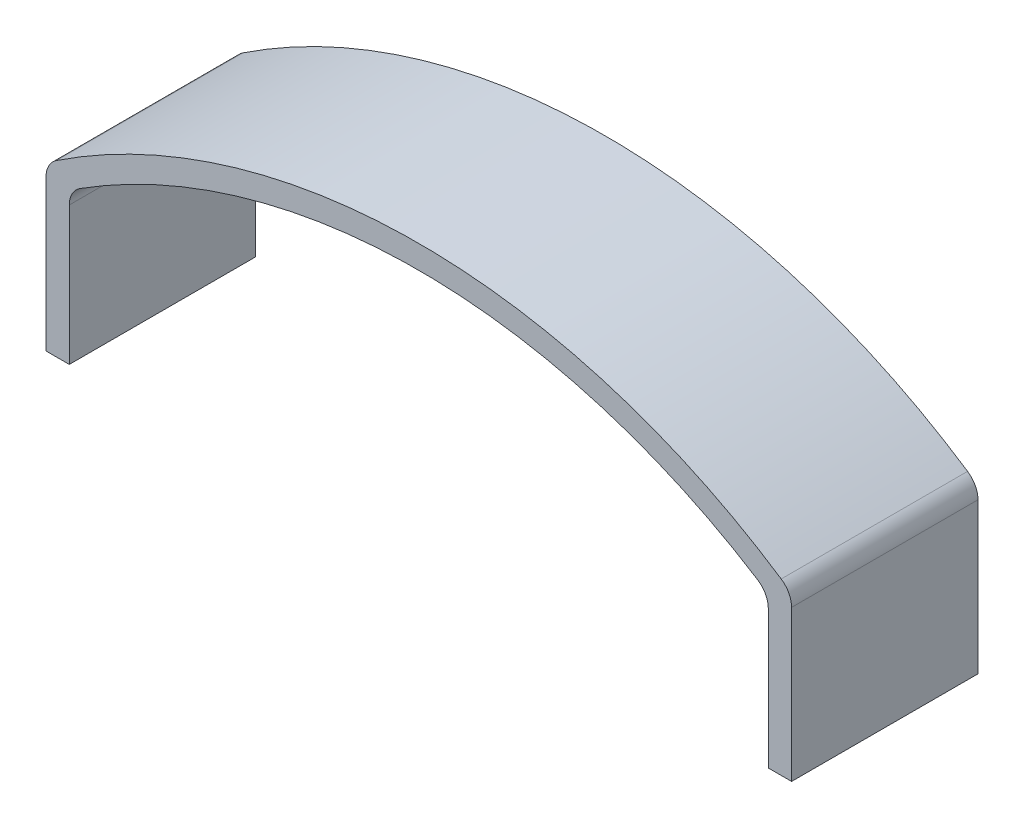
ISO-10303-21;
HEADER;
FILE_DESCRIPTION(('STEP AP214'),'2;1');
FILE_NAME('part.step','',(''),(''),'','','');
FILE_SCHEMA(('AUTOMOTIVE_DESIGN { 1 0 10303 214 1 1 1 1 }'));
ENDSEC;
DATA;
#1=APPLICATION_CONTEXT('core data for automotive mechanical design processes');
#2=APPLICATION_PROTOCOL_DEFINITION('international standard','automotive_design',2000,#1);
#3=PRODUCT_CONTEXT('',#1,'mechanical');
#4=PRODUCT('Part','Part','',(#3));
#5=PRODUCT_RELATED_PRODUCT_CATEGORY('part','',(#4));
#6=PRODUCT_DEFINITION_FORMATION('','',#4);
#7=PRODUCT_DEFINITION_CONTEXT('part definition',#1,'design');
#8=PRODUCT_DEFINITION('design','',#6,#7);
#9=PRODUCT_DEFINITION_SHAPE('','',#8);
#10=(LENGTH_UNIT() NAMED_UNIT(*) SI_UNIT(.MILLI.,.METRE.));
#11=(NAMED_UNIT(*) PLANE_ANGLE_UNIT() SI_UNIT($,.RADIAN.));
#12=(NAMED_UNIT(*) SI_UNIT($,.STERADIAN.) SOLID_ANGLE_UNIT());
#13=UNCERTAINTY_MEASURE_WITH_UNIT(LENGTH_MEASURE(1.E-05),#10,'distance_accuracy_value','');
#14=(GEOMETRIC_REPRESENTATION_CONTEXT(3) GLOBAL_UNCERTAINTY_ASSIGNED_CONTEXT((#13)) GLOBAL_UNIT_ASSIGNED_CONTEXT((#10,
#11,#12)) REPRESENTATION_CONTEXT('',''));
#15=CARTESIAN_POINT('',(0.,0.,0.));
#16=DIRECTION('',(0.,0.,1.));
#17=DIRECTION('',(1.,0.,0.));
#18=AXIS2_PLACEMENT_3D('',#15,#16,#17);
#19=CARTESIAN_POINT('',(-7.99559099778246,0.,2.));
#20=DIRECTION('',(0.,1.,0.));
#21=DIRECTION('',(0.,0.,1.));
#22=AXIS2_PLACEMENT_3D('',#19,#20,#21);
#23=PLANE('',#22);
#24=DIRECTION('',(1.,0.,0.));
#25=VECTOR('',#24,1.);
#26=CARTESIAN_POINT('',(-7.99559099778246,0.,-2.));
#27=LINE('',#26,#25);
#28=CARTESIAN_POINT('',(-7.99559099778246,0.,-2.));
#29=VERTEX_POINT('',#28);
#30=CARTESIAN_POINT('',(-7.49559099778246,0.,-2.));
#31=VERTEX_POINT('',#30);
#32=EDGE_CURVE('E128',#29,#31,#27,.T.);
#33=ORIENTED_EDGE('',*,*,#32,.T.);
#34=DIRECTION('',(0.,0.,-1.));
#35=VECTOR('',#34,1.);
#36=CARTESIAN_POINT('',(-7.49559099778246,0.,2.));
#37=LINE('',#36,#35);
#38=CARTESIAN_POINT('',(-7.49559099778246,0.,2.));
#39=VERTEX_POINT('',#38);
#40=EDGE_CURVE('E110',#39,#31,#37,.T.);
#41=ORIENTED_EDGE('',*,*,#40,.F.);
#42=DIRECTION('',(1.,0.,0.));
#43=VECTOR('',#42,1.);
#44=CARTESIAN_POINT('',(-7.99559099778246,0.,2.));
#45=LINE('',#44,#43);
#46=CARTESIAN_POINT('',(-7.99559099778246,0.,2.));
#47=VERTEX_POINT('',#46);
#48=EDGE_CURVE('E116',#47,#39,#45,.T.);
#49=ORIENTED_EDGE('',*,*,#48,.F.);
#50=DIRECTION('',(0.,0.,-1.));
#51=VECTOR('',#50,1.);
#52=CARTESIAN_POINT('',(-7.99559099778246,0.,2.));
#53=LINE('',#52,#51);
#54=EDGE_CURVE('E189',#47,#29,#53,.T.);
#55=ORIENTED_EDGE('',*,*,#54,.T.);
#56=EDGE_LOOP('',(#33,#41,#49,#55));
#57=FACE_BOUND('',#56,.T.);
#58=ADVANCED_FACE('F16',(#57),#23,.F.);
#59=CARTESIAN_POINT('',(-7.49559099778246,0.,2.));
#60=DIRECTION('',(-1.,0.,0.));
#61=DIRECTION('',(0.,0.,1.));
#62=AXIS2_PLACEMENT_3D('',#59,#60,#61);
#63=PLANE('',#62);
#64=DIRECTION('',(0.,1.,0.));
#65=VECTOR('',#64,1.);
#66=CARTESIAN_POINT('',(-7.49559099778246,0.,-2.));
#67=LINE('',#66,#65);
#68=CARTESIAN_POINT('',(-7.49559099778246,2.96374141714726,-2.));
#69=VERTEX_POINT('',#68);
#70=EDGE_CURVE('E168',#31,#69,#67,.T.);
#71=ORIENTED_EDGE('',*,*,#70,.T.);
#72=DIRECTION('',(0.,0.,1.));
#73=VECTOR('',#72,1.);
#74=CARTESIAN_POINT('',(-7.49559099778246,2.96374141714726,2.));
#75=LINE('',#74,#73);
#76=CARTESIAN_POINT('',(-7.49559099778246,2.96374141714726,2.));
#77=VERTEX_POINT('',#76);
#78=EDGE_CURVE('E113',#69,#77,#75,.T.);
#79=ORIENTED_EDGE('',*,*,#78,.T.);
#80=DIRECTION('',(0.,1.,0.));
#81=VECTOR('',#80,1.);
#82=CARTESIAN_POINT('',(-7.49559099778246,0.,2.));
#83=LINE('',#82,#81);
#84=EDGE_CURVE('E105',#39,#77,#83,.T.);
#85=ORIENTED_EDGE('',*,*,#84,.F.);
#86=ORIENTED_EDGE('',*,*,#40,.T.);
#87=EDGE_LOOP('',(#71,#79,#85,#86));
#88=FACE_BOUND('',#87,.T.);
#89=ADVANCED_FACE('F108',(#88),#63,.F.);
#90=CARTESIAN_POINT('',(0.00440900221753588,-8.04999999337819,2.));
#91=DIRECTION('',(0.,0.,-1.));
#92=DIRECTION('',(-1.,0.,0.));
#93=AXIS2_PLACEMENT_3D('',#90,#91,#92);
#94=CYLINDRICAL_SURFACE('',#93,13.5499999945564);
#95=CARTESIAN_POINT('',(0.00440900221753588,-8.04999999337819,-2.));
#96=DIRECTION('',(0.,0.,-1.));
#97=DIRECTION('',(-1.,0.,0.));
#98=AXIS2_PLACEMENT_3D('',#95,#96,#97);
#99=CIRCLE('',#98,13.5499999945564);
#100=CARTESIAN_POINT('',(-7.26379023161081,3.38572384684534,-2.));
#101=VERTEX_POINT('',#100);
#102=CARTESIAN_POINT('',(7.27260823604589,3.38572384684533,-2.));
#103=VERTEX_POINT('',#102);
#104=EDGE_CURVE('E170',#101,#103,#99,.T.);
#105=ORIENTED_EDGE('',*,*,#104,.T.);
#106=DIRECTION('',(0.,0.,-1.));
#107=VECTOR('',#106,1.);
#108=CARTESIAN_POINT('',(7.27260823604589,3.38572384684533,2.));
#109=LINE('',#108,#107);
#110=CARTESIAN_POINT('',(7.27260823604589,3.38572384684533,2.));
#111=VERTEX_POINT('',#110);
#112=EDGE_CURVE('E156',#103,#111,#109,.F.);
#113=ORIENTED_EDGE('',*,*,#112,.T.);
#114=CARTESIAN_POINT('',(0.00440900221753588,-8.04999999337819,2.));
#115=DIRECTION('',(0.,0.,-1.));
#116=DIRECTION('',(-1.,0.,0.));
#117=AXIS2_PLACEMENT_3D('',#114,#115,#116);
#118=CIRCLE('',#117,13.5499999945564);
#119=CARTESIAN_POINT('',(-7.26379023161081,3.38572384684534,2.));
#120=VERTEX_POINT('',#119);
#121=EDGE_CURVE('E115',#120,#111,#118,.T.);
#122=ORIENTED_EDGE('',*,*,#121,.F.);
#123=DIRECTION('',(0.,0.,-1.));
#124=VECTOR('',#123,1.);
#125=CARTESIAN_POINT('',(-7.26379023161081,3.38572384684534,2.));
#126=LINE('',#125,#124);
#127=EDGE_CURVE('E153',#120,#101,#126,.T.);
#128=ORIENTED_EDGE('',*,*,#127,.T.);
#129=EDGE_LOOP('',(#105,#113,#122,#128));
#130=FACE_BOUND('',#129,.T.);
#131=ADVANCED_FACE('F176',(#130),#94,.F.);
#132=CARTESIAN_POINT('',(7.50440900221754,3.23505649086147,2.));
#133=DIRECTION('',(1.,0.,0.));
#134=DIRECTION('',(0.,1.,0.));
#135=AXIS2_PLACEMENT_3D('',#132,#133,#134);
#136=PLANE('',#135);
#137=DIRECTION('',(0.,-1.,0.));
#138=VECTOR('',#137,1.);
#139=CARTESIAN_POINT('',(7.50440900221754,3.23505649086147,2.));
#140=LINE('',#139,#138);
#141=CARTESIAN_POINT('',(7.50440900221754,2.96374141714726,2.));
#142=VERTEX_POINT('',#141);
#143=CARTESIAN_POINT('',(7.50440900221754,0.,2.));
#144=VERTEX_POINT('',#143);
#145=EDGE_CURVE('E178',#142,#144,#140,.T.);
#146=ORIENTED_EDGE('',*,*,#145,.F.);
#147=DIRECTION('',(0.,0.,1.));
#148=VECTOR('',#147,1.);
#149=CARTESIAN_POINT('',(7.50440900221754,2.96374141714726,-2.));
#150=LINE('',#149,#148);
#151=CARTESIAN_POINT('',(7.50440900221754,2.96374141714726,-2.));
#152=VERTEX_POINT('',#151);
#153=EDGE_CURVE('E150',#142,#152,#150,.F.);
#154=ORIENTED_EDGE('',*,*,#153,.T.);
#155=DIRECTION('',(0.,-1.,0.));
#156=VECTOR('',#155,1.);
#157=CARTESIAN_POINT('',(7.50440900221754,3.23505649086147,-2.));
#158=LINE('',#157,#156);
#159=CARTESIAN_POINT('',(7.50440900221754,0.,-2.));
#160=VERTEX_POINT('',#159);
#161=EDGE_CURVE('E192',#152,#160,#158,.T.);
#162=ORIENTED_EDGE('',*,*,#161,.T.);
#163=DIRECTION('',(0.,0.,-1.));
#164=VECTOR('',#163,1.);
#165=CARTESIAN_POINT('',(7.50440900221754,0.,2.));
#166=LINE('',#165,#164);
#167=EDGE_CURVE('E130',#144,#160,#166,.T.);
#168=ORIENTED_EDGE('',*,*,#167,.F.);
#169=EDGE_LOOP('',(#146,#154,#162,#168));
#170=FACE_BOUND('',#169,.T.);
#171=ADVANCED_FACE('F322',(#170),#136,.F.);
#172=CARTESIAN_POINT('',(7.50440900221754,0.,2.));
#173=DIRECTION('',(0.,1.,0.));
#174=DIRECTION('',(-1.,0.,0.));
#175=AXIS2_PLACEMENT_3D('',#172,#173,#174);
#176=PLANE('',#175);
#177=DIRECTION('',(1.,0.,0.));
#178=VECTOR('',#177,1.);
#179=CARTESIAN_POINT('',(7.50440900221754,0.,-2.));
#180=LINE('',#179,#178);
#181=CARTESIAN_POINT('',(8.00440900221754,0.,-2.));
#182=VERTEX_POINT('',#181);
#183=EDGE_CURVE('E194',#160,#182,#180,.T.);
#184=ORIENTED_EDGE('',*,*,#183,.T.);
#185=DIRECTION('',(0.,0.,-1.));
#186=VECTOR('',#185,1.);
#187=CARTESIAN_POINT('',(8.00440900221754,0.,2.));
#188=LINE('',#187,#186);
#189=CARTESIAN_POINT('',(8.00440900221754,0.,2.));
#190=VERTEX_POINT('',#189);
#191=EDGE_CURVE('E135',#190,#182,#188,.T.);
#192=ORIENTED_EDGE('',*,*,#191,.F.);
#193=DIRECTION('',(1.,0.,0.));
#194=VECTOR('',#193,1.);
#195=CARTESIAN_POINT('',(7.50440900221754,0.,2.));
#196=LINE('',#195,#194);
#197=EDGE_CURVE('E180',#144,#190,#196,.T.);
#198=ORIENTED_EDGE('',*,*,#197,.F.);
#199=ORIENTED_EDGE('',*,*,#167,.T.);
#200=EDGE_LOOP('',(#184,#192,#198,#199));
#201=FACE_BOUND('',#200,.T.);
#202=ADVANCED_FACE('F313',(#201),#176,.F.);
#203=CARTESIAN_POINT('',(8.00440900221754,3.5,2.));
#204=DIRECTION('',(-1.,0.,0.));
#205=DIRECTION('',(0.,-1.,0.));
#206=AXIS2_PLACEMENT_3D('',#203,#204,#205);
#207=PLANE('',#206);
#208=DIRECTION('',(0.,1.,0.));
#209=VECTOR('',#208,1.);
#210=CARTESIAN_POINT('',(8.00440900221754,3.5,-2.));
#211=LINE('',#210,#209);
#212=CARTESIAN_POINT('',(8.00440900221754,3.23505649086147,-2.));
#213=VERTEX_POINT('',#212);
#214=EDGE_CURVE('E196',#182,#213,#211,.T.);
#215=ORIENTED_EDGE('',*,*,#214,.T.);
#216=DIRECTION('',(0.,0.,-1.));
#217=VECTOR('',#216,1.);
#218=CARTESIAN_POINT('',(8.00440900221754,3.23505649086147,2.));
#219=LINE('',#218,#217);
#220=CARTESIAN_POINT('',(8.00440900221754,3.23505649086147,2.));
#221=VERTEX_POINT('',#220);
#222=EDGE_CURVE('E145',#213,#221,#219,.F.);
#223=ORIENTED_EDGE('',*,*,#222,.T.);
#224=DIRECTION('',(0.,1.,0.));
#225=VECTOR('',#224,1.);
#226=CARTESIAN_POINT('',(8.00440900221754,3.5,2.));
#227=LINE('',#226,#225);
#228=EDGE_CURVE('E184',#190,#221,#227,.T.);
#229=ORIENTED_EDGE('',*,*,#228,.F.);
#230=ORIENTED_EDGE('',*,*,#191,.T.);
#231=EDGE_LOOP('',(#215,#223,#229,#230));
#232=FACE_BOUND('',#231,.T.);
#233=ADVANCED_FACE('F208',(#232),#207,.F.);
#234=CARTESIAN_POINT('',(0.00440900221753588,-8.04999999337819,2.));
#235=DIRECTION('',(0.,0.,-1.));
#236=DIRECTION('',(-1.,0.,0.));
#237=AXIS2_PLACEMENT_3D('',#234,#235,#236);
#238=CYLINDRICAL_SURFACE('',#237,14.0499999945564);
#239=CARTESIAN_POINT('',(0.00440900221753588,-8.04999999337819,2.));
#240=DIRECTION('',(0.,0.,1.));
#241=DIRECTION('',(-1.,0.,0.));
#242=AXIS2_PLACEMENT_3D('',#239,#240,#241);
#243=CIRCLE('',#242,14.0499999945564);
#244=CARTESIAN_POINT('',(7.78116176985639,3.65147923952469,2.));
#245=VERTEX_POINT('',#244);
#246=CARTESIAN_POINT('',(-7.77234376542132,3.6514792395247,2.));
#247=VERTEX_POINT('',#246);
#248=EDGE_CURVE('E186',#245,#247,#243,.T.);
#249=ORIENTED_EDGE('',*,*,#248,.F.);
#250=DIRECTION('',(0.,0.,-1.));
#251=VECTOR('',#250,1.);
#252=CARTESIAN_POINT('',(7.78116176985639,3.65147923952469,2.));
#253=LINE('',#252,#251);
#254=CARTESIAN_POINT('',(7.78116176985639,3.65147923952469,-2.));
#255=VERTEX_POINT('',#254);
#256=EDGE_CURVE('E132',#245,#255,#253,.T.);
#257=ORIENTED_EDGE('',*,*,#256,.T.);
#258=CARTESIAN_POINT('',(0.00440900221753588,-8.04999999337819,-2.));
#259=DIRECTION('',(0.,0.,1.));
#260=DIRECTION('',(-1.,0.,0.));
#261=AXIS2_PLACEMENT_3D('',#258,#259,#260);
#262=CIRCLE('',#261,14.0499999945564);
#263=CARTESIAN_POINT('',(-7.77234376542132,3.6514792395247,-2.));
#264=VERTEX_POINT('',#263);
#265=EDGE_CURVE('E199',#255,#264,#262,.T.);
#266=ORIENTED_EDGE('',*,*,#265,.T.);
#267=DIRECTION('',(0.,0.,-1.));
#268=VECTOR('',#267,1.);
#269=CARTESIAN_POINT('',(-7.77234376542132,3.6514792395247,2.));
#270=LINE('',#269,#268);
#271=EDGE_CURVE('E129',#264,#247,#270,.F.);
#272=ORIENTED_EDGE('',*,*,#271,.T.);
#273=EDGE_LOOP('',(#249,#257,#266,#272));
#274=FACE_BOUND('',#273,.T.);
#275=ADVANCED_FACE('F220',(#274),#238,.T.);
#276=CARTESIAN_POINT('',(-7.99559099778246,0.,2.));
#277=DIRECTION('',(1.,0.,0.));
#278=DIRECTION('',(0.,0.,-1.));
#279=AXIS2_PLACEMENT_3D('',#276,#277,#278);
#280=PLANE('',#279);
#281=DIRECTION('',(0.,-1.,0.));
#282=VECTOR('',#281,1.);
#283=CARTESIAN_POINT('',(-7.99559099778246,0.,2.));
#284=LINE('',#283,#282);
#285=CARTESIAN_POINT('',(-7.99559099778246,3.23505649086147,2.));
#286=VERTEX_POINT('',#285);
#287=EDGE_CURVE('E121',#286,#47,#284,.T.);
#288=ORIENTED_EDGE('',*,*,#287,.F.);
#289=DIRECTION('',(0.,0.,-1.));
#290=VECTOR('',#289,1.);
#291=CARTESIAN_POINT('',(-7.99559099778246,3.23505649086147,2.));
#292=LINE('',#291,#290);
#293=CARTESIAN_POINT('',(-7.99559099778246,3.23505649086147,-2.));
#294=VERTEX_POINT('',#293);
#295=EDGE_CURVE('E158',#286,#294,#292,.T.);
#296=ORIENTED_EDGE('',*,*,#295,.T.);
#297=DIRECTION('',(0.,-1.,0.));
#298=VECTOR('',#297,1.);
#299=CARTESIAN_POINT('',(-7.99559099778246,0.,-2.));
#300=LINE('',#299,#298);
#301=EDGE_CURVE('E125',#294,#29,#300,.T.);
#302=ORIENTED_EDGE('',*,*,#301,.T.);
#303=ORIENTED_EDGE('',*,*,#54,.F.);
#304=EDGE_LOOP('',(#288,#296,#302,#303));
#305=FACE_BOUND('',#304,.T.);
#306=ADVANCED_FACE('F227',(#305),#280,.F.);
#307=CARTESIAN_POINT('',(0.00440900221753588,-8.04999999337819,2.));
#308=DIRECTION('',(0.,0.,-1.));
#309=DIRECTION('',(-1.,0.,0.));
#310=AXIS2_PLACEMENT_3D('',#307,#308,#309);
#311=PLANE('',#310);
#312=ORIENTED_EDGE('',*,*,#228,.T.);
#313=CARTESIAN_POINT('',(7.50440900221754,3.23505649086147,2.));
#314=DIRECTION('',(0.,0.,-1.));
#315=DIRECTION('',(-1.,0.,0.));
#316=AXIS2_PLACEMENT_3D('',#313,#314,#315);
#317=CIRCLE('',#316,0.5);
#318=EDGE_CURVE('E148',#221,#245,#317,.F.);
#319=ORIENTED_EDGE('',*,*,#318,.T.);
#320=ORIENTED_EDGE('',*,*,#248,.T.);
#321=CARTESIAN_POINT('',(-7.49559099778246,3.23505649086147,2.));
#322=DIRECTION('',(0.,0.,-1.));
#323=DIRECTION('',(-1.,0.,0.));
#324=AXIS2_PLACEMENT_3D('',#321,#322,#323);
#325=CIRCLE('',#324,0.5);
#326=EDGE_CURVE('E31',#247,#286,#325,.F.);
#327=ORIENTED_EDGE('',*,*,#326,.T.);
#328=ORIENTED_EDGE('',*,*,#287,.T.);
#329=ORIENTED_EDGE('',*,*,#48,.T.);
#330=ORIENTED_EDGE('',*,*,#84,.T.);
#331=CARTESIAN_POINT('',(-6.99559099778246,2.96374141714726,2.));
#332=DIRECTION('',(0.,0.,-1.));
#333=DIRECTION('',(-1.,0.,0.));
#334=AXIS2_PLACEMENT_3D('',#331,#332,#333);
#335=CIRCLE('',#334,0.5);
#336=EDGE_CURVE('E10',#77,#120,#335,.T.);
#337=ORIENTED_EDGE('',*,*,#336,.T.);
#338=ORIENTED_EDGE('',*,*,#121,.T.);
#339=CARTESIAN_POINT('',(7.00440900221754,2.96374141714726,2.));
#340=DIRECTION('',(0.,0.,-1.));
#341=DIRECTION('',(-1.,0.,0.));
#342=AXIS2_PLACEMENT_3D('',#339,#340,#341);
#343=CIRCLE('',#342,0.5);
#344=EDGE_CURVE('E38',#111,#142,#343,.T.);
#345=ORIENTED_EDGE('',*,*,#344,.T.);
#346=ORIENTED_EDGE('',*,*,#145,.T.);
#347=ORIENTED_EDGE('',*,*,#197,.T.);
#348=EDGE_LOOP('',(#312,#319,#320,#327,#328,#329,#330,#337,#338,#345,#346,#347));
#349=FACE_BOUND('',#348,.T.);
#350=ADVANCED_FACE('F120',(#349),#311,.F.);
#351=CARTESIAN_POINT('',(0.00440900221753588,-8.04999999337819,-2.));
#352=DIRECTION('',(0.,0.,-1.));
#353=DIRECTION('',(-1.,0.,0.));
#354=AXIS2_PLACEMENT_3D('',#351,#352,#353);
#355=PLANE('',#354);
#356=ORIENTED_EDGE('',*,*,#265,.F.);
#357=CARTESIAN_POINT('',(7.50440900221754,3.23505649086147,-2.));
#358=DIRECTION('',(0.,0.,-1.));
#359=DIRECTION('',(-1.,0.,0.));
#360=AXIS2_PLACEMENT_3D('',#357,#358,#359);
#361=CIRCLE('',#360,0.5);
#362=EDGE_CURVE('E143',#255,#213,#361,.T.);
#363=ORIENTED_EDGE('',*,*,#362,.T.);
#364=ORIENTED_EDGE('',*,*,#214,.F.);
#365=ORIENTED_EDGE('',*,*,#183,.F.);
#366=ORIENTED_EDGE('',*,*,#161,.F.);
#367=CARTESIAN_POINT('',(7.00440900221754,2.96374141714726,-2.));
#368=DIRECTION('',(0.,0.,-1.));
#369=DIRECTION('',(-1.,0.,0.));
#370=AXIS2_PLACEMENT_3D('',#367,#368,#369);
#371=CIRCLE('',#370,0.5);
#372=EDGE_CURVE('E162',#152,#103,#371,.F.);
#373=ORIENTED_EDGE('',*,*,#372,.T.);
#374=ORIENTED_EDGE('',*,*,#104,.F.);
#375=CARTESIAN_POINT('',(-6.99559099778246,2.96374141714726,-2.));
#376=DIRECTION('',(0.,0.,-1.));
#377=DIRECTION('',(-1.,0.,0.));
#378=AXIS2_PLACEMENT_3D('',#375,#376,#377);
#379=CIRCLE('',#378,0.5);
#380=EDGE_CURVE('E24',#101,#69,#379,.F.);
#381=ORIENTED_EDGE('',*,*,#380,.T.);
#382=ORIENTED_EDGE('',*,*,#70,.F.);
#383=ORIENTED_EDGE('',*,*,#32,.F.);
#384=ORIENTED_EDGE('',*,*,#301,.F.);
#385=CARTESIAN_POINT('',(-7.49559099778246,3.23505649086147,-2.));
#386=DIRECTION('',(0.,0.,-1.));
#387=DIRECTION('',(-1.,0.,0.));
#388=AXIS2_PLACEMENT_3D('',#385,#386,#387);
#389=CIRCLE('',#388,0.5);
#390=EDGE_CURVE('E141',#294,#264,#389,.T.);
#391=ORIENTED_EDGE('',*,*,#390,.T.);
#392=EDGE_LOOP('',(#356,#363,#364,#365,#366,#373,#374,#381,#382,#383,#384,#391));
#393=FACE_BOUND('',#392,.T.);
#394=ADVANCED_FACE('F167',(#393),#355,.T.);
#395=CARTESIAN_POINT('',(7.50440900221754,3.23505649086147,2.));
#396=DIRECTION('',(0.,0.,-1.));
#397=DIRECTION('',(-1.,0.,0.));
#398=AXIS2_PLACEMENT_3D('',#395,#396,#397);
#399=CYLINDRICAL_SURFACE('',#398,0.5);
#400=ORIENTED_EDGE('',*,*,#318,.F.);
#401=ORIENTED_EDGE('',*,*,#222,.F.);
#402=ORIENTED_EDGE('',*,*,#362,.F.);
#403=ORIENTED_EDGE('',*,*,#256,.F.);
#404=EDGE_LOOP('',(#400,#401,#402,#403));
#405=FACE_BOUND('',#404,.T.);
#406=ADVANCED_FACE('F217',(#405),#399,.T.);
#407=CARTESIAN_POINT('',(7.00440900221754,2.96374141714726,2.));
#408=DIRECTION('',(0.,0.,-1.));
#409=DIRECTION('',(-1.,0.,0.));
#410=AXIS2_PLACEMENT_3D('',#407,#408,#409);
#411=CYLINDRICAL_SURFACE('',#410,0.5);
#412=ORIENTED_EDGE('',*,*,#344,.F.);
#413=ORIENTED_EDGE('',*,*,#112,.F.);
#414=ORIENTED_EDGE('',*,*,#372,.F.);
#415=ORIENTED_EDGE('',*,*,#153,.F.);
#416=EDGE_LOOP('',(#412,#413,#414,#415));
#417=FACE_BOUND('',#416,.T.);
#418=ADVANCED_FACE('F248',(#417),#411,.F.);
#419=CARTESIAN_POINT('',(-7.49559099778246,3.23505649086147,2.));
#420=DIRECTION('',(0.,0.,-1.));
#421=DIRECTION('',(-1.,0.,0.));
#422=AXIS2_PLACEMENT_3D('',#419,#420,#421);
#423=CYLINDRICAL_SURFACE('',#422,0.5);
#424=ORIENTED_EDGE('',*,*,#326,.F.);
#425=ORIENTED_EDGE('',*,*,#271,.F.);
#426=ORIENTED_EDGE('',*,*,#390,.F.);
#427=ORIENTED_EDGE('',*,*,#295,.F.);
#428=EDGE_LOOP('',(#424,#425,#426,#427));
#429=FACE_BOUND('',#428,.T.);
#430=ADVANCED_FACE('F224',(#429),#423,.T.);
#431=CARTESIAN_POINT('',(-6.99559099778246,2.96374141714726,2.));
#432=DIRECTION('',(0.,0.,-1.));
#433=DIRECTION('',(-1.,0.,0.));
#434=AXIS2_PLACEMENT_3D('',#431,#432,#433);
#435=CYLINDRICAL_SURFACE('',#434,0.5);
#436=ORIENTED_EDGE('',*,*,#336,.F.);
#437=ORIENTED_EDGE('',*,*,#78,.F.);
#438=ORIENTED_EDGE('',*,*,#380,.F.);
#439=ORIENTED_EDGE('',*,*,#127,.F.);
#440=EDGE_LOOP('',(#436,#437,#438,#439));
#441=FACE_BOUND('',#440,.T.);
#442=ADVANCED_FACE('F18',(#441),#435,.F.);
#443=CLOSED_SHELL('',(#58,#89,#131,#171,#202,#233,#275,#306,#350,#394,#406,#418,#430,#442));
#444=MANIFOLD_SOLID_BREP('B1',#443);
#445=ADVANCED_BREP_SHAPE_REPRESENTATION('',(#18,#444),#14);
#446=SHAPE_DEFINITION_REPRESENTATION(#9,#445);
ENDSEC;
END-ISO-10303-21;
